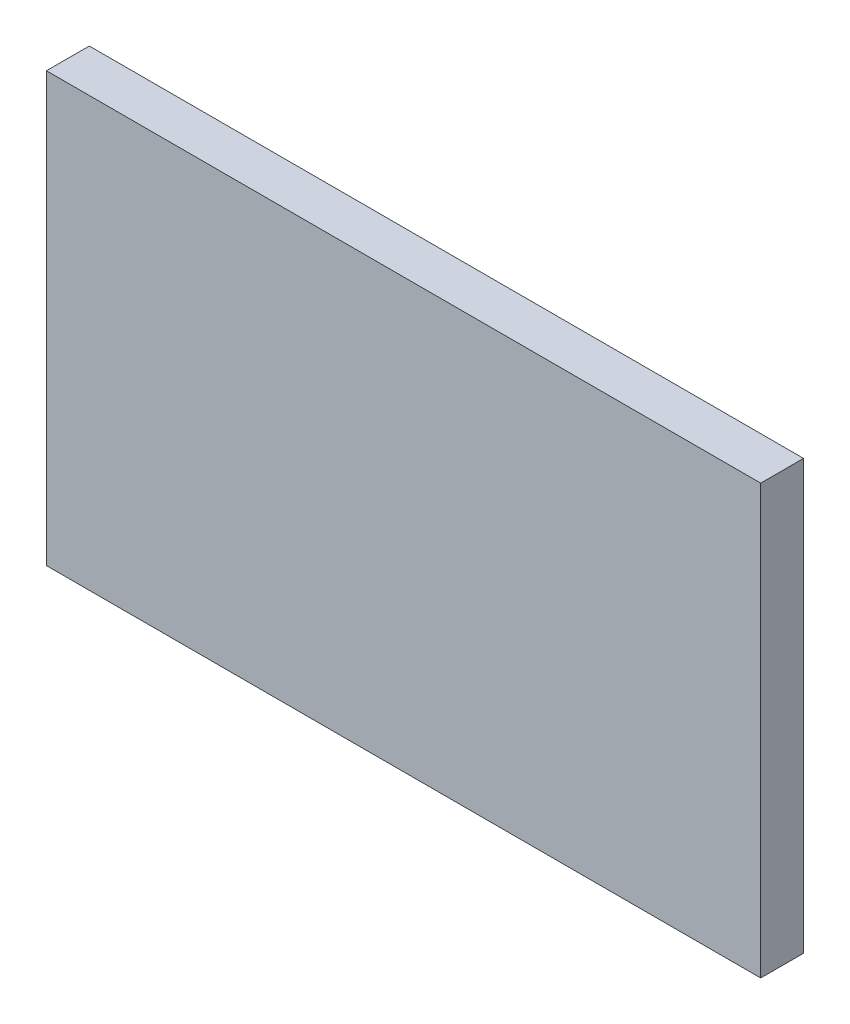
ISO-10303-21;
HEADER;
FILE_DESCRIPTION(('STEP AP214'),'2;1');
FILE_NAME('part.step','',(''),(''),'','','');
FILE_SCHEMA(('AUTOMOTIVE_DESIGN { 1 0 10303 214 1 1 1 1 }'));
ENDSEC;
DATA;
#1=APPLICATION_CONTEXT('core data for automotive mechanical design processes');
#2=APPLICATION_PROTOCOL_DEFINITION('international standard','automotive_design',2000,#1);
#3=PRODUCT_CONTEXT('',#1,'mechanical');
#4=PRODUCT('Part','Part','',(#3));
#5=PRODUCT_RELATED_PRODUCT_CATEGORY('part','',(#4));
#6=PRODUCT_DEFINITION_FORMATION('','',#4);
#7=PRODUCT_DEFINITION_CONTEXT('part definition',#1,'design');
#8=PRODUCT_DEFINITION('design','',#6,#7);
#9=PRODUCT_DEFINITION_SHAPE('','',#8);
#10=(LENGTH_UNIT() NAMED_UNIT(*) SI_UNIT(.MILLI.,.METRE.));
#11=(NAMED_UNIT(*) PLANE_ANGLE_UNIT() SI_UNIT($,.RADIAN.));
#12=(NAMED_UNIT(*) SI_UNIT($,.STERADIAN.) SOLID_ANGLE_UNIT());
#13=UNCERTAINTY_MEASURE_WITH_UNIT(LENGTH_MEASURE(1.E-05),#10,'distance_accuracy_value','');
#14=(GEOMETRIC_REPRESENTATION_CONTEXT(3) GLOBAL_UNCERTAINTY_ASSIGNED_CONTEXT((#13)) GLOBAL_UNIT_ASSIGNED_CONTEXT((#10,
#11,#12)) REPRESENTATION_CONTEXT('',''));
#15=CARTESIAN_POINT('',(0.,0.,0.));
#16=DIRECTION('',(0.,0.,1.));
#17=DIRECTION('',(1.,0.,0.));
#18=AXIS2_PLACEMENT_3D('',#15,#16,#17);
#19=CARTESIAN_POINT('',(0.,0.,-15.));
#20=DIRECTION('',(-1.,0.,0.));
#21=DIRECTION('',(0.,-1.,0.));
#22=AXIS2_PLACEMENT_3D('',#19,#20,#21);
#23=PLANE('',#22);
#24=DIRECTION('',(0.,-1.,0.));
#25=VECTOR('',#24,1.);
#26=CARTESIAN_POINT('',(0.,0.,0.));
#27=LINE('',#26,#25);
#28=CARTESIAN_POINT('',(0.,0.,0.));
#29=VERTEX_POINT('',#28);
#30=CARTESIAN_POINT('',(0.,-150.,0.));
#31=VERTEX_POINT('',#30);
#32=EDGE_CURVE('E102',#29,#31,#27,.T.);
#33=ORIENTED_EDGE('',*,*,#32,.F.);
#34=DIRECTION('',(0.,0.,1.));
#35=VECTOR('',#34,1.);
#36=CARTESIAN_POINT('',(0.,0.,-15.));
#37=LINE('',#36,#35);
#38=CARTESIAN_POINT('',(0.,0.,-15.));
#39=VERTEX_POINT('',#38);
#40=EDGE_CURVE('E11',#39,#29,#37,.T.);
#41=ORIENTED_EDGE('',*,*,#40,.F.);
#42=DIRECTION('',(0.,-1.,0.));
#43=VECTOR('',#42,1.);
#44=CARTESIAN_POINT('',(0.,0.,-15.));
#45=LINE('',#44,#43);
#46=CARTESIAN_POINT('',(0.,-150.,-15.));
#47=VERTEX_POINT('',#46);
#48=EDGE_CURVE('E96',#39,#47,#45,.T.);
#49=ORIENTED_EDGE('',*,*,#48,.T.);
#50=DIRECTION('',(0.,0.,1.));
#51=VECTOR('',#50,1.);
#52=CARTESIAN_POINT('',(0.,-150.,-15.));
#53=LINE('',#52,#51);
#54=EDGE_CURVE('E41',#47,#31,#53,.T.);
#55=ORIENTED_EDGE('',*,*,#54,.T.);
#56=EDGE_LOOP('',(#33,#41,#49,#55));
#57=FACE_BOUND('',#56,.T.);
#58=ADVANCED_FACE('F38',(#57),#23,.T.);
#59=CARTESIAN_POINT('',(0.,0.,-15.));
#60=DIRECTION('',(0.,1.,0.));
#61=DIRECTION('',(0.,0.,1.));
#62=AXIS2_PLACEMENT_3D('',#59,#60,#61);
#63=PLANE('',#62);
#64=DIRECTION('',(-1.,0.,0.));
#65=VECTOR('',#64,1.);
#66=CARTESIAN_POINT('',(0.,0.,0.));
#67=LINE('',#66,#65);
#68=CARTESIAN_POINT('',(250.,0.,0.));
#69=VERTEX_POINT('',#68);
#70=EDGE_CURVE('E98',#69,#29,#67,.T.);
#71=ORIENTED_EDGE('',*,*,#70,.F.);
#72=DIRECTION('',(0.,0.,1.));
#73=VECTOR('',#72,1.);
#74=CARTESIAN_POINT('',(250.,0.,-15.));
#75=LINE('',#74,#73);
#76=CARTESIAN_POINT('',(250.,0.,-15.));
#77=VERTEX_POINT('',#76);
#78=EDGE_CURVE('E47',#77,#69,#75,.T.);
#79=ORIENTED_EDGE('',*,*,#78,.F.);
#80=DIRECTION('',(-1.,0.,0.));
#81=VECTOR('',#80,1.);
#82=CARTESIAN_POINT('',(0.,0.,-15.));
#83=LINE('',#82,#81);
#84=EDGE_CURVE('E93',#77,#39,#83,.T.);
#85=ORIENTED_EDGE('',*,*,#84,.T.);
#86=ORIENTED_EDGE('',*,*,#40,.T.);
#87=EDGE_LOOP('',(#71,#79,#85,#86));
#88=FACE_BOUND('',#87,.T.);
#89=ADVANCED_FACE('F112',(#88),#63,.T.);
#90=CARTESIAN_POINT('',(250.,0.,-15.));
#91=DIRECTION('',(1.,0.,0.));
#92=DIRECTION('',(0.,1.,0.));
#93=AXIS2_PLACEMENT_3D('',#90,#91,#92);
#94=PLANE('',#93);
#95=DIRECTION('',(0.,1.,0.));
#96=VECTOR('',#95,1.);
#97=CARTESIAN_POINT('',(250.,0.,0.));
#98=LINE('',#97,#96);
#99=CARTESIAN_POINT('',(250.,-150.,0.));
#100=VERTEX_POINT('',#99);
#101=EDGE_CURVE('E88',#100,#69,#98,.T.);
#102=ORIENTED_EDGE('',*,*,#101,.F.);
#103=DIRECTION('',(0.,0.,1.));
#104=VECTOR('',#103,1.);
#105=CARTESIAN_POINT('',(250.,-150.,-15.));
#106=LINE('',#105,#104);
#107=CARTESIAN_POINT('',(250.,-150.,-15.));
#108=VERTEX_POINT('',#107);
#109=EDGE_CURVE('E83',#108,#100,#106,.T.);
#110=ORIENTED_EDGE('',*,*,#109,.F.);
#111=DIRECTION('',(0.,1.,0.));
#112=VECTOR('',#111,1.);
#113=CARTESIAN_POINT('',(250.,0.,-15.));
#114=LINE('',#113,#112);
#115=EDGE_CURVE('E86',#108,#77,#114,.T.);
#116=ORIENTED_EDGE('',*,*,#115,.T.);
#117=ORIENTED_EDGE('',*,*,#78,.T.);
#118=EDGE_LOOP('',(#102,#110,#116,#117));
#119=FACE_BOUND('',#118,.T.);
#120=ADVANCED_FACE('F85',(#119),#94,.T.);
#121=CARTESIAN_POINT('',(0.,-150.,-15.));
#122=DIRECTION('',(0.,-1.,0.));
#123=DIRECTION('',(0.,0.,-1.));
#124=AXIS2_PLACEMENT_3D('',#121,#122,#123);
#125=PLANE('',#124);
#126=DIRECTION('',(1.,0.,0.));
#127=VECTOR('',#126,1.);
#128=CARTESIAN_POINT('',(0.,-150.,0.));
#129=LINE('',#128,#127);
#130=EDGE_CURVE('E105',#31,#100,#129,.T.);
#131=ORIENTED_EDGE('',*,*,#130,.F.);
#132=ORIENTED_EDGE('',*,*,#54,.F.);
#133=DIRECTION('',(1.,0.,0.));
#134=VECTOR('',#133,1.);
#135=CARTESIAN_POINT('',(0.,-150.,-15.));
#136=LINE('',#135,#134);
#137=EDGE_CURVE('E92',#47,#108,#136,.T.);
#138=ORIENTED_EDGE('',*,*,#137,.T.);
#139=ORIENTED_EDGE('',*,*,#109,.T.);
#140=EDGE_LOOP('',(#131,#132,#138,#139));
#141=FACE_BOUND('',#140,.T.);
#142=ADVANCED_FACE('F95',(#141),#125,.T.);
#143=CARTESIAN_POINT('',(0.,0.,-15.));
#144=DIRECTION('',(0.,0.,1.));
#145=DIRECTION('',(1.,0.,0.));
#146=AXIS2_PLACEMENT_3D('',#143,#144,#145);
#147=PLANE('',#146);
#148=ORIENTED_EDGE('',*,*,#48,.F.);
#149=ORIENTED_EDGE('',*,*,#84,.F.);
#150=ORIENTED_EDGE('',*,*,#115,.F.);
#151=ORIENTED_EDGE('',*,*,#137,.F.);
#152=EDGE_LOOP('',(#148,#149,#150,#151));
#153=FACE_BOUND('',#152,.T.);
#154=ADVANCED_FACE('F91',(#153),#147,.F.);
#155=CARTESIAN_POINT('',(0.,0.,0.));
#156=DIRECTION('',(0.,0.,1.));
#157=DIRECTION('',(1.,0.,0.));
#158=AXIS2_PLACEMENT_3D('',#155,#156,#157);
#159=PLANE('',#158);
#160=ORIENTED_EDGE('',*,*,#32,.T.);
#161=ORIENTED_EDGE('',*,*,#130,.T.);
#162=ORIENTED_EDGE('',*,*,#101,.T.);
#163=ORIENTED_EDGE('',*,*,#70,.T.);
#164=EDGE_LOOP('',(#160,#161,#162,#163));
#165=FACE_BOUND('',#164,.T.);
#166=ADVANCED_FACE('F111',(#165),#159,.T.);
#167=CLOSED_SHELL('',(#58,#89,#120,#142,#154,#166));
#168=MANIFOLD_SOLID_BREP('B2',#167);
#169=ADVANCED_BREP_SHAPE_REPRESENTATION('',(#18,#168),#14);
#170=SHAPE_DEFINITION_REPRESENTATION(#9,#169);
ENDSEC;
END-ISO-10303-21;
